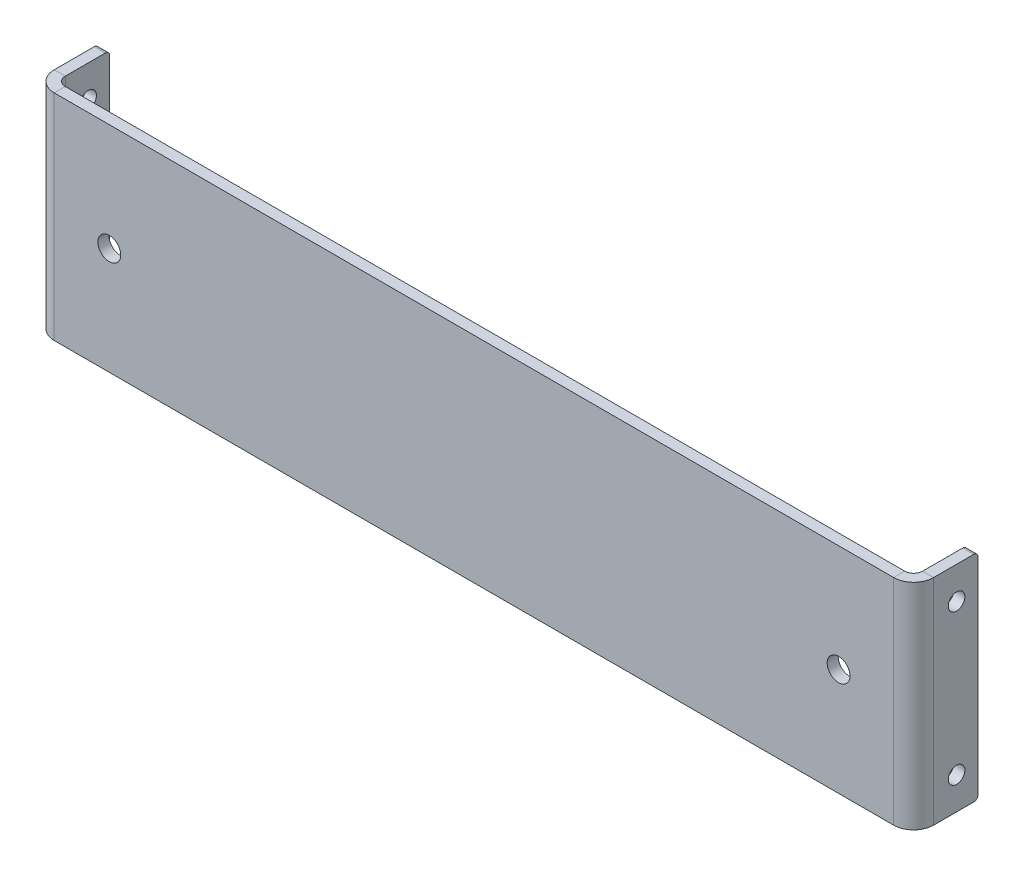
ISO-10303-21;
HEADER;
FILE_DESCRIPTION(('STEP AP214'),'2;1');
FILE_NAME('part.step','',(''),(''),'','','');
FILE_SCHEMA(('AUTOMOTIVE_DESIGN { 1 0 10303 214 1 1 1 1 }'));
ENDSEC;
DATA;
#1=APPLICATION_CONTEXT('core data for automotive mechanical design processes');
#2=APPLICATION_PROTOCOL_DEFINITION('international standard','automotive_design',2000,#1);
#3=PRODUCT_CONTEXT('',#1,'mechanical');
#4=PRODUCT('Part','Part','',(#3));
#5=PRODUCT_RELATED_PRODUCT_CATEGORY('part','',(#4));
#6=PRODUCT_DEFINITION_FORMATION('','',#4);
#7=PRODUCT_DEFINITION_CONTEXT('part definition',#1,'design');
#8=PRODUCT_DEFINITION('design','',#6,#7);
#9=PRODUCT_DEFINITION_SHAPE('','',#8);
#10=(LENGTH_UNIT() NAMED_UNIT(*) SI_UNIT(.MILLI.,.METRE.));
#11=(NAMED_UNIT(*) PLANE_ANGLE_UNIT() SI_UNIT($,.RADIAN.));
#12=(NAMED_UNIT(*) SI_UNIT($,.STERADIAN.) SOLID_ANGLE_UNIT());
#13=UNCERTAINTY_MEASURE_WITH_UNIT(LENGTH_MEASURE(1.E-05),#10,'distance_accuracy_value','');
#14=(GEOMETRIC_REPRESENTATION_CONTEXT(3) GLOBAL_UNCERTAINTY_ASSIGNED_CONTEXT((#13)) GLOBAL_UNIT_ASSIGNED_CONTEXT((#10,
#11,#12)) REPRESENTATION_CONTEXT('',''));
#15=CARTESIAN_POINT('',(0.,0.,0.));
#16=DIRECTION('',(0.,0.,1.));
#17=DIRECTION('',(1.,0.,0.));
#18=AXIS2_PLACEMENT_3D('',#15,#16,#17);
#19=CARTESIAN_POINT('',(0.,0.,-3.2639));
#20=DIRECTION('',(0.,0.,-1.));
#21=DIRECTION('',(-1.,0.,0.));
#22=AXIS2_PLACEMENT_3D('',#19,#20,#21);
#23=PLANE('',#22);
#24=CARTESIAN_POINT('',(-107.95,0.,-3.2639));
#25=DIRECTION('',(0.,0.,-1.));
#26=DIRECTION('',(-1.,0.,0.));
#27=AXIS2_PLACEMENT_3D('',#24,#25,#26);
#28=CIRCLE('',#27,3.3782);
#29=CARTESIAN_POINT('',(-111.3282,0.,-3.2639));
#30=VERTEX_POINT('',#29);
#31=EDGE_CURVE('E443',#30,#30,#28,.T.);
#32=ORIENTED_EDGE('',*,*,#31,.F.);
#33=EDGE_LOOP('',(#32));
#34=FACE_BOUND('',#33,.T.);
#35=CARTESIAN_POINT('',(107.95,0.,-3.2639));
#36=DIRECTION('',(0.,0.,-1.));
#37=DIRECTION('',(-1.,0.,0.));
#38=AXIS2_PLACEMENT_3D('',#35,#36,#37);
#39=CIRCLE('',#38,3.3782);
#40=CARTESIAN_POINT('',(104.5718,0.,-3.2639));
#41=VERTEX_POINT('',#40);
#42=EDGE_CURVE('E437',#41,#41,#39,.T.);
#43=ORIENTED_EDGE('',*,*,#42,.F.);
#44=EDGE_LOOP('',(#43));
#45=FACE_BOUND('',#44,.T.);
#46=DIRECTION('',(1.,0.,0.));
#47=VECTOR('',#46,1.);
#48=CARTESIAN_POINT('',(-130.175,-31.75,-3.2639));
#49=LINE('',#48,#47);
#50=CARTESIAN_POINT('',(-124.25426,-31.75,-3.26390000000002));
#51=VERTEX_POINT('',#50);
#52=CARTESIAN_POINT('',(124.25426,-31.75,-3.2639));
#53=VERTEX_POINT('',#52);
#54=EDGE_CURVE('E311',#51,#53,#49,.T.);
#55=ORIENTED_EDGE('',*,*,#54,.F.);
#56=DIRECTION('',(0.,1.,0.));
#57=VECTOR('',#56,1.);
#58=CARTESIAN_POINT('',(-124.25426,31.75,-3.26390000000002));
#59=LINE('',#58,#57);
#60=CARTESIAN_POINT('',(-124.25426,31.75,-3.26390000000002));
#61=VERTEX_POINT('',#60);
#62=EDGE_CURVE('E249',#61,#51,#59,.F.);
#63=ORIENTED_EDGE('',*,*,#62,.F.);
#64=DIRECTION('',(-1.,0.,0.));
#65=VECTOR('',#64,1.);
#66=CARTESIAN_POINT('',(-130.175,31.75,-3.2639));
#67=LINE('',#66,#65);
#68=CARTESIAN_POINT('',(124.25426,31.75,-3.2639));
#69=VERTEX_POINT('',#68);
#70=EDGE_CURVE('E308',#69,#61,#67,.T.);
#71=ORIENTED_EDGE('',*,*,#70,.F.);
#72=DIRECTION('',(0.,-1.,0.));
#73=VECTOR('',#72,1.);
#74=CARTESIAN_POINT('',(124.25426,-31.75,-3.26390000000002));
#75=LINE('',#74,#73);
#76=EDGE_CURVE('E298',#53,#69,#75,.F.);
#77=ORIENTED_EDGE('',*,*,#76,.F.);
#78=EDGE_LOOP('',(#55,#63,#71,#77));
#79=FACE_BOUND('',#78,.T.);
#80=ADVANCED_FACE('F78',(#34,#45,#79),#23,.T.);
#81=CARTESIAN_POINT('',(0.,0.,0.));
#82=DIRECTION('',(0.,0.,-1.));
#83=DIRECTION('',(-1.,0.,0.));
#84=AXIS2_PLACEMENT_3D('',#81,#82,#83);
#85=PLANE('',#84);
#86=CARTESIAN_POINT('',(-107.95,0.,0.));
#87=DIRECTION('',(0.,0.,1.));
#88=DIRECTION('',(1.,0.,0.));
#89=AXIS2_PLACEMENT_3D('',#86,#87,#88);
#90=CIRCLE('',#89,3.3782);
#91=CARTESIAN_POINT('',(-104.5718,0.,0.));
#92=VERTEX_POINT('',#91);
#93=EDGE_CURVE('E446',#92,#92,#90,.T.);
#94=ORIENTED_EDGE('',*,*,#93,.F.);
#95=EDGE_LOOP('',(#94));
#96=FACE_BOUND('',#95,.T.);
#97=CARTESIAN_POINT('',(107.95,0.,0.));
#98=DIRECTION('',(0.,0.,1.));
#99=DIRECTION('',(1.,0.,0.));
#100=AXIS2_PLACEMENT_3D('',#97,#98,#99);
#101=CIRCLE('',#100,3.3782);
#102=CARTESIAN_POINT('',(111.3282,0.,0.));
#103=VERTEX_POINT('',#102);
#104=EDGE_CURVE('E440',#103,#103,#101,.T.);
#105=ORIENTED_EDGE('',*,*,#104,.F.);
#106=EDGE_LOOP('',(#105));
#107=FACE_BOUND('',#106,.T.);
#108=DIRECTION('',(0.,1.,0.));
#109=VECTOR('',#108,1.);
#110=CARTESIAN_POINT('',(-124.25426,31.75,0.));
#111=LINE('',#110,#109);
#112=CARTESIAN_POINT('',(-124.25426,31.75,0.));
#113=VERTEX_POINT('',#112);
#114=CARTESIAN_POINT('',(-124.25426,-31.75,0.));
#115=VERTEX_POINT('',#114);
#116=EDGE_CURVE('E216',#113,#115,#111,.F.);
#117=ORIENTED_EDGE('',*,*,#116,.T.);
#118=DIRECTION('',(1.,0.,0.));
#119=VECTOR('',#118,1.);
#120=CARTESIAN_POINT('',(-130.175,-31.75,0.));
#121=LINE('',#120,#119);
#122=CARTESIAN_POINT('',(124.25426,-31.75,0.));
#123=VERTEX_POINT('',#122);
#124=EDGE_CURVE('E312',#115,#123,#121,.T.);
#125=ORIENTED_EDGE('',*,*,#124,.T.);
#126=DIRECTION('',(0.,-1.,0.));
#127=VECTOR('',#126,1.);
#128=CARTESIAN_POINT('',(124.25426,-31.75,0.));
#129=LINE('',#128,#127);
#130=CARTESIAN_POINT('',(124.25426,31.75,0.));
#131=VERTEX_POINT('',#130);
#132=EDGE_CURVE('E286',#123,#131,#129,.F.);
#133=ORIENTED_EDGE('',*,*,#132,.T.);
#134=DIRECTION('',(-1.,0.,0.));
#135=VECTOR('',#134,1.);
#136=CARTESIAN_POINT('',(-130.175,31.75,0.));
#137=LINE('',#136,#135);
#138=EDGE_CURVE('E306',#131,#113,#137,.T.);
#139=ORIENTED_EDGE('',*,*,#138,.T.);
#140=EDGE_LOOP('',(#117,#125,#133,#139));
#141=FACE_BOUND('',#140,.T.);
#142=ADVANCED_FACE('F389',(#96,#107,#141),#85,.F.);
#143=CARTESIAN_POINT('',(-130.175,31.75,-3.2639));
#144=DIRECTION('',(0.,1.,0.));
#145=DIRECTION('',(0.,0.,1.));
#146=AXIS2_PLACEMENT_3D('',#143,#144,#145);
#147=PLANE('',#146);
#148=ORIENTED_EDGE('',*,*,#70,.T.);
#149=DIRECTION('',(0.,0.,1.));
#150=VECTOR('',#149,1.);
#151=CARTESIAN_POINT('',(-124.25426,31.75,-3.26390000000002));
#152=LINE('',#151,#150);
#153=EDGE_CURVE('E245',#61,#113,#152,.T.);
#154=ORIENTED_EDGE('',*,*,#153,.T.);
#155=ORIENTED_EDGE('',*,*,#138,.F.);
#156=DIRECTION('',(0.,0.,1.));
#157=VECTOR('',#156,1.);
#158=CARTESIAN_POINT('',(124.25426,31.75,-3.26390000000002));
#159=LINE('',#158,#157);
#160=EDGE_CURVE('E303',#69,#131,#159,.T.);
#161=ORIENTED_EDGE('',*,*,#160,.F.);
#162=EDGE_LOOP('',(#148,#154,#155,#161));
#163=FACE_BOUND('',#162,.T.);
#164=ADVANCED_FACE('F392',(#163),#147,.T.);
#165=CARTESIAN_POINT('',(-130.175,-31.75,-3.2639));
#166=DIRECTION('',(0.,-1.,0.));
#167=DIRECTION('',(0.,0.,-1.));
#168=AXIS2_PLACEMENT_3D('',#165,#166,#167);
#169=PLANE('',#168);
#170=DIRECTION('',(0.,0.,1.));
#171=VECTOR('',#170,1.);
#172=CARTESIAN_POINT('',(-124.25426,-31.75,-3.26390000000002));
#173=LINE('',#172,#171);
#174=EDGE_CURVE('E253',#51,#115,#173,.T.);
#175=ORIENTED_EDGE('',*,*,#174,.F.);
#176=ORIENTED_EDGE('',*,*,#54,.T.);
#177=DIRECTION('',(0.,0.,1.));
#178=VECTOR('',#177,1.);
#179=CARTESIAN_POINT('',(124.25426,-31.75,-3.26390000000002));
#180=LINE('',#179,#178);
#181=EDGE_CURVE('E292',#53,#123,#180,.T.);
#182=ORIENTED_EDGE('',*,*,#181,.T.);
#183=ORIENTED_EDGE('',*,*,#124,.F.);
#184=EDGE_LOOP('',(#175,#176,#182,#183));
#185=FACE_BOUND('',#184,.T.);
#186=ADVANCED_FACE('F387',(#185),#169,.T.);
#187=CARTESIAN_POINT('',(124.25426,31.75,-5.92074000000002));
#188=DIRECTION('',(0.,1.,0.));
#189=DIRECTION('',(0.,0.,1.));
#190=AXIS2_PLACEMENT_3D('',#187,#188,#189);
#191=PLANE('',#190);
#192=DIRECTION('',(1.,0.,0.));
#193=VECTOR('',#192,1.);
#194=CARTESIAN_POINT('',(130.175,31.75,-5.92074));
#195=LINE('',#194,#193);
#196=CARTESIAN_POINT('',(126.9111,31.75,-5.92074000000001));
#197=VERTEX_POINT('',#196);
#198=CARTESIAN_POINT('',(130.175,31.75,-5.92074));
#199=VERTEX_POINT('',#198);
#200=EDGE_CURVE('E256',#197,#199,#195,.T.);
#201=ORIENTED_EDGE('',*,*,#200,.F.);
#202=CARTESIAN_POINT('',(124.25426,31.75,-5.92074000000002));
#203=DIRECTION('',(0.,-1.,0.));
#204=DIRECTION('',(0.,0.,-1.));
#205=AXIS2_PLACEMENT_3D('',#202,#203,#204);
#206=CIRCLE('',#205,2.65683999999999);
#207=EDGE_CURVE('E295',#69,#197,#206,.F.);
#208=ORIENTED_EDGE('',*,*,#207,.F.);
#209=ORIENTED_EDGE('',*,*,#160,.T.);
#210=CARTESIAN_POINT('',(124.25426,31.75,-5.92074000000002));
#211=DIRECTION('',(0.,-1.,0.));
#212=DIRECTION('',(0.,0.,-1.));
#213=AXIS2_PLACEMENT_3D('',#210,#211,#212);
#214=CIRCLE('',#213,5.92073999999999);
#215=EDGE_CURVE('E288',#131,#199,#214,.F.);
#216=ORIENTED_EDGE('',*,*,#215,.T.);
#217=EDGE_LOOP('',(#201,#208,#209,#216));
#218=FACE_BOUND('',#217,.T.);
#219=ADVANCED_FACE('F373',(#218),#191,.T.);
#220=CARTESIAN_POINT('',(124.25426,-31.75,-5.92074000000002));
#221=DIRECTION('',(0.,1.,0.));
#222=DIRECTION('',(0.,0.,1.));
#223=AXIS2_PLACEMENT_3D('',#220,#221,#222);
#224=PLANE('',#223);
#225=CARTESIAN_POINT('',(124.25426,-31.75,-5.92074000000002));
#226=DIRECTION('',(0.,-1.,0.));
#227=DIRECTION('',(0.,0.,-1.));
#228=AXIS2_PLACEMENT_3D('',#225,#226,#227);
#229=CIRCLE('',#228,2.65683999999999);
#230=CARTESIAN_POINT('',(126.9111,-31.75,-5.92074000000001));
#231=VERTEX_POINT('',#230);
#232=EDGE_CURVE('E261',#231,#53,#229,.T.);
#233=ORIENTED_EDGE('',*,*,#232,.F.);
#234=DIRECTION('',(1.,0.,0.));
#235=VECTOR('',#234,1.);
#236=CARTESIAN_POINT('',(126.9111,-31.75,-5.92074000000001));
#237=LINE('',#236,#235);
#238=CARTESIAN_POINT('',(130.175,-31.75,-5.92074));
#239=VERTEX_POINT('',#238);
#240=EDGE_CURVE('E278',#231,#239,#237,.T.);
#241=ORIENTED_EDGE('',*,*,#240,.T.);
#242=CARTESIAN_POINT('',(124.25426,-31.75,-5.92074000000002));
#243=DIRECTION('',(0.,-1.,0.));
#244=DIRECTION('',(0.,0.,-1.));
#245=AXIS2_PLACEMENT_3D('',#242,#243,#244);
#246=CIRCLE('',#245,5.92073999999999);
#247=EDGE_CURVE('E289',#239,#123,#246,.T.);
#248=ORIENTED_EDGE('',*,*,#247,.T.);
#249=ORIENTED_EDGE('',*,*,#181,.F.);
#250=EDGE_LOOP('',(#233,#241,#248,#249));
#251=FACE_BOUND('',#250,.T.);
#252=ADVANCED_FACE('F366',(#251),#224,.F.);
#253=CARTESIAN_POINT('',(124.25426,-31.75,-5.92074000000002));
#254=DIRECTION('',(0.,-1.,0.));
#255=DIRECTION('',(1.,0.,0.));
#256=AXIS2_PLACEMENT_3D('',#253,#254,#255);
#257=CYLINDRICAL_SURFACE('',#256,5.92073999999999);
#258=ORIENTED_EDGE('',*,*,#132,.F.);
#259=ORIENTED_EDGE('',*,*,#247,.F.);
#260=DIRECTION('',(0.,-1.,0.));
#261=VECTOR('',#260,1.);
#262=CARTESIAN_POINT('',(130.175,0.,-5.92074));
#263=LINE('',#262,#261);
#264=EDGE_CURVE('E275',#199,#239,#263,.T.);
#265=ORIENTED_EDGE('',*,*,#264,.F.);
#266=ORIENTED_EDGE('',*,*,#215,.F.);
#267=EDGE_LOOP('',(#258,#259,#265,#266));
#268=FACE_BOUND('',#267,.T.);
#269=ADVANCED_FACE('F371',(#268),#257,.T.);
#270=CARTESIAN_POINT('',(124.25426,-31.75,-5.92074000000002));
#271=DIRECTION('',(0.,-1.,0.));
#272=DIRECTION('',(1.,0.,0.));
#273=AXIS2_PLACEMENT_3D('',#270,#271,#272);
#274=CYLINDRICAL_SURFACE('',#273,2.65683999999999);
#275=ORIENTED_EDGE('',*,*,#76,.T.);
#276=ORIENTED_EDGE('',*,*,#207,.T.);
#277=DIRECTION('',(0.,1.,0.));
#278=VECTOR('',#277,1.);
#279=CARTESIAN_POINT('',(126.9111,31.75,-5.92074000000001));
#280=LINE('',#279,#278);
#281=EDGE_CURVE('E281',#197,#231,#280,.F.);
#282=ORIENTED_EDGE('',*,*,#281,.T.);
#283=ORIENTED_EDGE('',*,*,#232,.T.);
#284=EDGE_LOOP('',(#275,#276,#282,#283));
#285=FACE_BOUND('',#284,.T.);
#286=ADVANCED_FACE('F380',(#285),#274,.F.);
#287=CARTESIAN_POINT('',(130.175,-31.75,-3.26389999999999));
#288=DIRECTION('',(0.,-1.,0.));
#289=DIRECTION('',(0.,0.,-1.));
#290=AXIS2_PLACEMENT_3D('',#287,#288,#289);
#291=PLANE('',#290);
#292=DIRECTION('',(0.,0.,-1.));
#293=VECTOR('',#292,1.);
#294=CARTESIAN_POINT('',(126.9111,-31.75,4.57754867353493E-13));
#295=LINE('',#294,#293);
#296=CARTESIAN_POINT('',(126.9111,-31.75,-17.78));
#297=VERTEX_POINT('',#296);
#298=EDGE_CURVE('E267',#297,#231,#295,.F.);
#299=ORIENTED_EDGE('',*,*,#298,.F.);
#300=DIRECTION('',(-1.,0.,0.));
#301=VECTOR('',#300,1.);
#302=CARTESIAN_POINT('',(130.175,-31.75,-17.78));
#303=LINE('',#302,#301);
#304=CARTESIAN_POINT('',(130.175,-31.75,-17.78));
#305=VERTEX_POINT('',#304);
#306=EDGE_CURVE('E101',#297,#305,#303,.F.);
#307=ORIENTED_EDGE('',*,*,#306,.T.);
#308=DIRECTION('',(0.,0.,1.));
#309=VECTOR('',#308,1.);
#310=CARTESIAN_POINT('',(130.175,-31.75,-3.26389999999999));
#311=LINE('',#310,#309);
#312=EDGE_CURVE('E259',#305,#239,#311,.T.);
#313=ORIENTED_EDGE('',*,*,#312,.T.);
#314=ORIENTED_EDGE('',*,*,#240,.F.);
#315=EDGE_LOOP('',(#299,#307,#313,#314));
#316=FACE_BOUND('',#315,.T.);
#317=ADVANCED_FACE('F362',(#316),#291,.T.);
#318=CARTESIAN_POINT('',(130.175,31.75,-19.05));
#319=DIRECTION('',(0.,1.,0.));
#320=DIRECTION('',(0.,0.,1.));
#321=AXIS2_PLACEMENT_3D('',#318,#319,#320);
#322=PLANE('',#321);
#323=DIRECTION('',(0.,0.,-1.));
#324=VECTOR('',#323,1.);
#325=CARTESIAN_POINT('',(130.175,31.75,-19.05));
#326=LINE('',#325,#324);
#327=CARTESIAN_POINT('',(130.175,31.75,-17.78));
#328=VERTEX_POINT('',#327);
#329=EDGE_CURVE('E265',#199,#328,#326,.T.);
#330=ORIENTED_EDGE('',*,*,#329,.T.);
#331=DIRECTION('',(-1.,0.,0.));
#332=VECTOR('',#331,1.);
#333=CARTESIAN_POINT('',(130.175,31.75,-17.78));
#334=LINE('',#333,#332);
#335=CARTESIAN_POINT('',(126.9111,31.75,-17.78));
#336=VERTEX_POINT('',#335);
#337=EDGE_CURVE('E13',#328,#336,#334,.T.);
#338=ORIENTED_EDGE('',*,*,#337,.T.);
#339=DIRECTION('',(0.,0.,1.));
#340=VECTOR('',#339,1.);
#341=CARTESIAN_POINT('',(126.9111,31.75,4.43798926275643E-13));
#342=LINE('',#341,#340);
#343=EDGE_CURVE('E272',#197,#336,#342,.F.);
#344=ORIENTED_EDGE('',*,*,#343,.F.);
#345=ORIENTED_EDGE('',*,*,#200,.T.);
#346=EDGE_LOOP('',(#330,#338,#344,#345));
#347=FACE_BOUND('',#346,.T.);
#348=ADVANCED_FACE('F377',(#347),#322,.T.);
#349=CARTESIAN_POINT('',(130.175,0.,4.69150713295343E-13));
#350=DIRECTION('',(1.,0.,0.));
#351=DIRECTION('',(0.,0.,-1.));
#352=AXIS2_PLACEMENT_3D('',#349,#350,#351);
#353=PLANE('',#352);
#354=CARTESIAN_POINT('',(130.175,22.225,-12.7));
#355=DIRECTION('',(1.,0.,0.));
#356=DIRECTION('',(0.,0.,-1.));
#357=AXIS2_PLACEMENT_3D('',#354,#355,#356);
#358=CIRCLE('',#357,2.45745);
#359=CARTESIAN_POINT('',(130.175,22.225,-15.15745));
#360=VERTEX_POINT('',#359);
#361=EDGE_CURVE('E434',#360,#360,#358,.T.);
#362=ORIENTED_EDGE('',*,*,#361,.F.);
#363=EDGE_LOOP('',(#362));
#364=FACE_BOUND('',#363,.T.);
#365=CARTESIAN_POINT('',(130.175,-22.225,-12.7));
#366=DIRECTION('',(1.,0.,0.));
#367=DIRECTION('',(0.,0.,-1.));
#368=AXIS2_PLACEMENT_3D('',#365,#366,#367);
#369=CIRCLE('',#368,2.45745);
#370=CARTESIAN_POINT('',(130.175,-22.225,-15.15745));
#371=VERTEX_POINT('',#370);
#372=EDGE_CURVE('E427',#371,#371,#369,.T.);
#373=ORIENTED_EDGE('',*,*,#372,.F.);
#374=EDGE_LOOP('',(#373));
#375=FACE_BOUND('',#374,.T.);
#376=ORIENTED_EDGE('',*,*,#312,.F.);
#377=CARTESIAN_POINT('',(130.175,-30.48,-17.78));
#378=DIRECTION('',(1.,0.,0.));
#379=DIRECTION('',(0.,0.,-1.));
#380=AXIS2_PLACEMENT_3D('',#377,#378,#379);
#381=CIRCLE('',#380,1.27);
#382=CARTESIAN_POINT('',(130.175,-30.48,-19.05));
#383=VERTEX_POINT('',#382);
#384=EDGE_CURVE('E86',#305,#383,#381,.T.);
#385=ORIENTED_EDGE('',*,*,#384,.T.);
#386=DIRECTION('',(0.,-1.,0.));
#387=VECTOR('',#386,1.);
#388=CARTESIAN_POINT('',(130.175,-31.75,-19.05));
#389=LINE('',#388,#387);
#390=CARTESIAN_POINT('',(130.175,30.48,-19.05));
#391=VERTEX_POINT('',#390);
#392=EDGE_CURVE('E262',#391,#383,#389,.T.);
#393=ORIENTED_EDGE('',*,*,#392,.F.);
#394=CARTESIAN_POINT('',(130.175,30.48,-17.78));
#395=DIRECTION('',(1.,0.,0.));
#396=DIRECTION('',(0.,0.,-1.));
#397=AXIS2_PLACEMENT_3D('',#394,#395,#396);
#398=CIRCLE('',#397,1.27);
#399=EDGE_CURVE('E93',#391,#328,#398,.T.);
#400=ORIENTED_EDGE('',*,*,#399,.T.);
#401=ORIENTED_EDGE('',*,*,#329,.F.);
#402=ORIENTED_EDGE('',*,*,#264,.T.);
#403=EDGE_LOOP('',(#376,#385,#393,#400,#401,#402));
#404=FACE_BOUND('',#403,.T.);
#405=ADVANCED_FACE('F350',(#364,#375,#404),#353,.T.);
#406=CARTESIAN_POINT('',(126.9111,0.,4.57754867353493E-13));
#407=DIRECTION('',(1.,0.,0.));
#408=DIRECTION('',(0.,0.,-1.));
#409=AXIS2_PLACEMENT_3D('',#406,#407,#408);
#410=PLANE('',#409);
#411=CARTESIAN_POINT('',(126.9111,22.225,-12.7));
#412=DIRECTION('',(1.,0.,0.));
#413=DIRECTION('',(0.,0.,-1.));
#414=AXIS2_PLACEMENT_3D('',#411,#412,#413);
#415=CIRCLE('',#414,2.45744999999998);
#416=CARTESIAN_POINT('',(126.9111,22.225,-15.15745));
#417=VERTEX_POINT('',#416);
#418=EDGE_CURVE('E321',#417,#417,#415,.T.);
#419=ORIENTED_EDGE('',*,*,#418,.T.);
#420=EDGE_LOOP('',(#419));
#421=FACE_BOUND('',#420,.T.);
#422=CARTESIAN_POINT('',(126.9111,-22.225,-12.7));
#423=DIRECTION('',(1.,0.,0.));
#424=DIRECTION('',(0.,0.,-1.));
#425=AXIS2_PLACEMENT_3D('',#422,#423,#424);
#426=CIRCLE('',#425,2.45744999999998);
#427=CARTESIAN_POINT('',(126.9111,-22.225,-15.15745));
#428=VERTEX_POINT('',#427);
#429=EDGE_CURVE('E242',#428,#428,#426,.T.);
#430=ORIENTED_EDGE('',*,*,#429,.T.);
#431=EDGE_LOOP('',(#430));
#432=FACE_BOUND('',#431,.T.);
#433=DIRECTION('',(0.,1.,0.));
#434=VECTOR('',#433,1.);
#435=CARTESIAN_POINT('',(126.9111,0.,-19.05));
#436=LINE('',#435,#434);
#437=CARTESIAN_POINT('',(126.9111,30.48,-19.05));
#438=VERTEX_POINT('',#437);
#439=CARTESIAN_POINT('',(126.9111,-30.48,-19.05));
#440=VERTEX_POINT('',#439);
#441=EDGE_CURVE('E269',#438,#440,#436,.F.);
#442=ORIENTED_EDGE('',*,*,#441,.T.);
#443=CARTESIAN_POINT('',(126.9111,-30.48,-17.78));
#444=DIRECTION('',(1.,0.,0.));
#445=DIRECTION('',(0.,0.,-1.));
#446=AXIS2_PLACEMENT_3D('',#443,#444,#445);
#447=CIRCLE('',#446,1.27);
#448=EDGE_CURVE('E346',#440,#297,#447,.F.);
#449=ORIENTED_EDGE('',*,*,#448,.T.);
#450=ORIENTED_EDGE('',*,*,#298,.T.);
#451=ORIENTED_EDGE('',*,*,#281,.F.);
#452=ORIENTED_EDGE('',*,*,#343,.T.);
#453=CARTESIAN_POINT('',(126.9111,30.48,-17.78));
#454=DIRECTION('',(1.,0.,0.));
#455=DIRECTION('',(0.,0.,-1.));
#456=AXIS2_PLACEMENT_3D('',#453,#454,#455);
#457=CIRCLE('',#456,1.27);
#458=EDGE_CURVE('E344',#336,#438,#457,.F.);
#459=ORIENTED_EDGE('',*,*,#458,.T.);
#460=EDGE_LOOP('',(#442,#449,#450,#451,#452,#459));
#461=FACE_BOUND('',#460,.T.);
#462=ADVANCED_FACE('F359',(#421,#432,#461),#410,.F.);
#463=CARTESIAN_POINT('',(130.175,-31.75,-19.05));
#464=DIRECTION('',(0.,0.,-1.));
#465=DIRECTION('',(-1.,0.,0.));
#466=AXIS2_PLACEMENT_3D('',#463,#464,#465);
#467=PLANE('',#466);
#468=ORIENTED_EDGE('',*,*,#392,.T.);
#469=DIRECTION('',(-1.,0.,0.));
#470=VECTOR('',#469,1.);
#471=CARTESIAN_POINT('',(130.175,-30.48,-19.05));
#472=LINE('',#471,#470);
#473=EDGE_CURVE('E341',#383,#440,#472,.T.);
#474=ORIENTED_EDGE('',*,*,#473,.T.);
#475=ORIENTED_EDGE('',*,*,#441,.F.);
#476=DIRECTION('',(-1.,0.,0.));
#477=VECTOR('',#476,1.);
#478=CARTESIAN_POINT('',(130.175,30.48,-19.05));
#479=LINE('',#478,#477);
#480=EDGE_CURVE('E339',#438,#391,#479,.F.);
#481=ORIENTED_EDGE('',*,*,#480,.T.);
#482=EDGE_LOOP('',(#468,#474,#475,#481));
#483=FACE_BOUND('',#482,.T.);
#484=ADVANCED_FACE('F354',(#483),#467,.T.);
#485=CARTESIAN_POINT('',(-124.25426,-31.75,-5.92074000000002));
#486=DIRECTION('',(0.,-1.,0.));
#487=DIRECTION('',(0.,0.,-1.));
#488=AXIS2_PLACEMENT_3D('',#485,#486,#487);
#489=PLANE('',#488);
#490=DIRECTION('',(-1.,0.,0.));
#491=VECTOR('',#490,1.);
#492=CARTESIAN_POINT('',(-130.175,-31.75,-5.92074));
#493=LINE('',#492,#491);
#494=CARTESIAN_POINT('',(-126.9111,-31.75,-5.92074000000001));
#495=VERTEX_POINT('',#494);
#496=CARTESIAN_POINT('',(-130.175,-31.75,-5.92074));
#497=VERTEX_POINT('',#496);
#498=EDGE_CURVE('E239',#495,#497,#493,.T.);
#499=ORIENTED_EDGE('',*,*,#498,.F.);
#500=CARTESIAN_POINT('',(-124.25426,-31.75,-5.92074000000002));
#501=DIRECTION('',(0.,1.,0.));
#502=DIRECTION('',(0.,0.,1.));
#503=AXIS2_PLACEMENT_3D('',#500,#501,#502);
#504=CIRCLE('',#503,2.65683999999999);
#505=EDGE_CURVE('E219',#51,#495,#504,.F.);
#506=ORIENTED_EDGE('',*,*,#505,.F.);
#507=ORIENTED_EDGE('',*,*,#174,.T.);
#508=CARTESIAN_POINT('',(-124.25426,-31.75,-5.92074000000002));
#509=DIRECTION('',(0.,1.,0.));
#510=DIRECTION('',(0.,0.,1.));
#511=AXIS2_PLACEMENT_3D('',#508,#509,#510);
#512=CIRCLE('',#511,5.92073999999999);
#513=EDGE_CURVE('E244',#115,#497,#512,.F.);
#514=ORIENTED_EDGE('',*,*,#513,.T.);
#515=EDGE_LOOP('',(#499,#506,#507,#514));
#516=FACE_BOUND('',#515,.T.);
#517=ADVANCED_FACE('F587',(#516),#489,.T.);
#518=CARTESIAN_POINT('',(-124.25426,31.75,-5.92074000000002));
#519=DIRECTION('',(0.,-1.,0.));
#520=DIRECTION('',(0.,0.,-1.));
#521=AXIS2_PLACEMENT_3D('',#518,#519,#520);
#522=PLANE('',#521);
#523=CARTESIAN_POINT('',(-124.25426,31.75,-5.92074000000002));
#524=DIRECTION('',(0.,1.,0.));
#525=DIRECTION('',(0.,0.,1.));
#526=AXIS2_PLACEMENT_3D('',#523,#524,#525);
#527=CIRCLE('',#526,2.65683999999999);
#528=CARTESIAN_POINT('',(-126.9111,31.75,-5.92074000000001));
#529=VERTEX_POINT('',#528);
#530=EDGE_CURVE('E205',#529,#61,#527,.T.);
#531=ORIENTED_EDGE('',*,*,#530,.F.);
#532=DIRECTION('',(-1.,0.,0.));
#533=VECTOR('',#532,1.);
#534=CARTESIAN_POINT('',(-126.9111,31.75,-5.92074000000001));
#535=LINE('',#534,#533);
#536=CARTESIAN_POINT('',(-130.175,31.75,-5.92074));
#537=VERTEX_POINT('',#536);
#538=EDGE_CURVE('E199',#529,#537,#535,.T.);
#539=ORIENTED_EDGE('',*,*,#538,.T.);
#540=CARTESIAN_POINT('',(-124.25426,31.75,-5.92074000000002));
#541=DIRECTION('',(0.,1.,0.));
#542=DIRECTION('',(0.,0.,1.));
#543=AXIS2_PLACEMENT_3D('',#540,#541,#542);
#544=CIRCLE('',#543,5.92073999999999);
#545=EDGE_CURVE('E211',#537,#113,#544,.T.);
#546=ORIENTED_EDGE('',*,*,#545,.T.);
#547=ORIENTED_EDGE('',*,*,#153,.F.);
#548=EDGE_LOOP('',(#531,#539,#546,#547));
#549=FACE_BOUND('',#548,.T.);
#550=ADVANCED_FACE('F222',(#549),#522,.F.);
#551=CARTESIAN_POINT('',(-124.25426,31.75,-5.92074000000002));
#552=DIRECTION('',(0.,1.,0.));
#553=DIRECTION('',(-1.,0.,0.));
#554=AXIS2_PLACEMENT_3D('',#551,#552,#553);
#555=CYLINDRICAL_SURFACE('',#554,5.92073999999999);
#556=ORIENTED_EDGE('',*,*,#116,.F.);
#557=ORIENTED_EDGE('',*,*,#545,.F.);
#558=DIRECTION('',(0.,1.,0.));
#559=VECTOR('',#558,1.);
#560=CARTESIAN_POINT('',(-130.175,-31.75,-5.92074));
#561=LINE('',#560,#559);
#562=EDGE_CURVE('E214',#537,#497,#561,.F.);
#563=ORIENTED_EDGE('',*,*,#562,.T.);
#564=ORIENTED_EDGE('',*,*,#513,.F.);
#565=EDGE_LOOP('',(#556,#557,#563,#564));
#566=FACE_BOUND('',#565,.T.);
#567=ADVANCED_FACE('F212',(#566),#555,.T.);
#568=CARTESIAN_POINT('',(-124.25426,31.75,-5.92074000000002));
#569=DIRECTION('',(0.,1.,0.));
#570=DIRECTION('',(-1.,0.,0.));
#571=AXIS2_PLACEMENT_3D('',#568,#569,#570);
#572=CYLINDRICAL_SURFACE('',#571,2.65683999999999);
#573=ORIENTED_EDGE('',*,*,#62,.T.);
#574=ORIENTED_EDGE('',*,*,#505,.T.);
#575=DIRECTION('',(0.,1.,0.));
#576=VECTOR('',#575,1.);
#577=CARTESIAN_POINT('',(-126.9111,-31.75,-5.92074000000001));
#578=LINE('',#577,#576);
#579=EDGE_CURVE('E224',#495,#529,#578,.T.);
#580=ORIENTED_EDGE('',*,*,#579,.T.);
#581=ORIENTED_EDGE('',*,*,#530,.T.);
#582=EDGE_LOOP('',(#573,#574,#580,#581));
#583=FACE_BOUND('',#582,.T.);
#584=ADVANCED_FACE('F394',(#583),#572,.F.);
#585=CARTESIAN_POINT('',(-130.175,-31.75,-3.26389999999999));
#586=DIRECTION('',(0.,-1.,0.));
#587=DIRECTION('',(0.,0.,-1.));
#588=AXIS2_PLACEMENT_3D('',#585,#586,#587);
#589=PLANE('',#588);
#590=DIRECTION('',(0.,0.,1.));
#591=VECTOR('',#590,1.);
#592=CARTESIAN_POINT('',(-130.175,-31.75,-3.26389999999999));
#593=LINE('',#592,#591);
#594=CARTESIAN_POINT('',(-130.175,-31.75,-17.78));
#595=VERTEX_POINT('',#594);
#596=EDGE_CURVE('E229',#497,#595,#593,.F.);
#597=ORIENTED_EDGE('',*,*,#596,.T.);
#598=DIRECTION('',(1.,0.,0.));
#599=VECTOR('',#598,1.);
#600=CARTESIAN_POINT('',(-130.175,-31.75,-17.78));
#601=LINE('',#600,#599);
#602=CARTESIAN_POINT('',(-126.9111,-31.75,-17.78));
#603=VERTEX_POINT('',#602);
#604=EDGE_CURVE('E336',#595,#603,#601,.T.);
#605=ORIENTED_EDGE('',*,*,#604,.T.);
#606=DIRECTION('',(0.,0.,-1.));
#607=VECTOR('',#606,1.);
#608=CARTESIAN_POINT('',(-126.9111,-31.75,4.57754867353493E-13));
#609=LINE('',#608,#607);
#610=EDGE_CURVE('E230',#495,#603,#609,.T.);
#611=ORIENTED_EDGE('',*,*,#610,.F.);
#612=ORIENTED_EDGE('',*,*,#498,.T.);
#613=EDGE_LOOP('',(#597,#605,#611,#612));
#614=FACE_BOUND('',#613,.T.);
#615=ADVANCED_FACE('F403',(#614),#589,.T.);
#616=CARTESIAN_POINT('',(-130.175,31.75,-19.05));
#617=DIRECTION('',(0.,1.,0.));
#618=DIRECTION('',(0.,0.,1.));
#619=AXIS2_PLACEMENT_3D('',#616,#617,#618);
#620=PLANE('',#619);
#621=DIRECTION('',(0.,0.,1.));
#622=VECTOR('',#621,1.);
#623=CARTESIAN_POINT('',(-126.9111,31.75,4.43798926275643E-13));
#624=LINE('',#623,#622);
#625=CARTESIAN_POINT('',(-126.9111,31.75,-17.78));
#626=VERTEX_POINT('',#625);
#627=EDGE_CURVE('E401',#626,#529,#624,.T.);
#628=ORIENTED_EDGE('',*,*,#627,.F.);
#629=DIRECTION('',(1.,0.,0.));
#630=VECTOR('',#629,1.);
#631=CARTESIAN_POINT('',(-130.175,31.75,-17.78));
#632=LINE('',#631,#630);
#633=CARTESIAN_POINT('',(-130.175,31.75,-17.78));
#634=VERTEX_POINT('',#633);
#635=EDGE_CURVE('E201',#626,#634,#632,.F.);
#636=ORIENTED_EDGE('',*,*,#635,.T.);
#637=DIRECTION('',(0.,0.,-1.));
#638=VECTOR('',#637,1.);
#639=CARTESIAN_POINT('',(-130.175,31.75,-19.05));
#640=LINE('',#639,#638);
#641=EDGE_CURVE('E194',#634,#537,#640,.F.);
#642=ORIENTED_EDGE('',*,*,#641,.T.);
#643=ORIENTED_EDGE('',*,*,#538,.F.);
#644=EDGE_LOOP('',(#628,#636,#642,#643));
#645=FACE_BOUND('',#644,.T.);
#646=ADVANCED_FACE('F197',(#645),#620,.T.);
#647=CARTESIAN_POINT('',(-130.175,0.,4.69150713295344E-13));
#648=DIRECTION('',(1.,0.,0.));
#649=DIRECTION('',(0.,0.,-1.));
#650=AXIS2_PLACEMENT_3D('',#647,#648,#649);
#651=PLANE('',#650);
#652=CARTESIAN_POINT('',(-130.175,22.225,-12.7000000000009));
#653=DIRECTION('',(1.,0.,0.));
#654=DIRECTION('',(0.,0.,-1.));
#655=AXIS2_PLACEMENT_3D('',#652,#653,#654);
#656=CIRCLE('',#655,2.45744999999997);
#657=CARTESIAN_POINT('',(-130.175,22.225,-15.1574500000009));
#658=VERTEX_POINT('',#657);
#659=EDGE_CURVE('E322',#658,#658,#656,.T.);
#660=ORIENTED_EDGE('',*,*,#659,.T.);
#661=EDGE_LOOP('',(#660));
#662=FACE_BOUND('',#661,.T.);
#663=CARTESIAN_POINT('',(-130.175,-22.225,-12.7000000000009));
#664=DIRECTION('',(1.,0.,0.));
#665=DIRECTION('',(0.,0.,-1.));
#666=AXIS2_PLACEMENT_3D('',#663,#664,#665);
#667=CIRCLE('',#666,2.45744999999997);
#668=CARTESIAN_POINT('',(-130.175,-22.225,-15.1574500000009));
#669=VERTEX_POINT('',#668);
#670=EDGE_CURVE('E424',#669,#669,#667,.T.);
#671=ORIENTED_EDGE('',*,*,#670,.T.);
#672=EDGE_LOOP('',(#671));
#673=FACE_BOUND('',#672,.T.);
#674=ORIENTED_EDGE('',*,*,#641,.F.);
#675=CARTESIAN_POINT('',(-130.175,30.48,-17.78));
#676=DIRECTION('',(1.,0.,0.));
#677=DIRECTION('',(0.,0.,-1.));
#678=AXIS2_PLACEMENT_3D('',#675,#676,#677);
#679=CIRCLE('',#678,1.27);
#680=CARTESIAN_POINT('',(-130.175,30.48,-19.05));
#681=VERTEX_POINT('',#680);
#682=EDGE_CURVE('E334',#634,#681,#679,.F.);
#683=ORIENTED_EDGE('',*,*,#682,.T.);
#684=DIRECTION('',(0.,-1.,0.));
#685=VECTOR('',#684,1.);
#686=CARTESIAN_POINT('',(-130.175,-31.75,-19.05));
#687=LINE('',#686,#685);
#688=CARTESIAN_POINT('',(-130.175,-30.48,-19.05));
#689=VERTEX_POINT('',#688);
#690=EDGE_CURVE('E206',#689,#681,#687,.F.);
#691=ORIENTED_EDGE('',*,*,#690,.F.);
#692=CARTESIAN_POINT('',(-130.175,-30.48,-17.78));
#693=DIRECTION('',(1.,0.,0.));
#694=DIRECTION('',(0.,0.,-1.));
#695=AXIS2_PLACEMENT_3D('',#692,#693,#694);
#696=CIRCLE('',#695,1.27);
#697=EDGE_CURVE('E332',#689,#595,#696,.F.);
#698=ORIENTED_EDGE('',*,*,#697,.T.);
#699=ORIENTED_EDGE('',*,*,#596,.F.);
#700=ORIENTED_EDGE('',*,*,#562,.F.);
#701=EDGE_LOOP('',(#674,#683,#691,#698,#699,#700));
#702=FACE_BOUND('',#701,.T.);
#703=ADVANCED_FACE('F227',(#662,#673,#702),#651,.F.);
#704=CARTESIAN_POINT('',(-126.9111,0.,4.57754867353493E-13));
#705=DIRECTION('',(1.,0.,0.));
#706=DIRECTION('',(0.,0.,-1.));
#707=AXIS2_PLACEMENT_3D('',#704,#705,#706);
#708=PLANE('',#707);
#709=CARTESIAN_POINT('',(-126.9111,22.225,-12.7000000000009));
#710=DIRECTION('',(1.,0.,0.));
#711=DIRECTION('',(0.,0.,-1.));
#712=AXIS2_PLACEMENT_3D('',#709,#710,#711);
#713=CIRCLE('',#712,2.45744999999998);
#714=CARTESIAN_POINT('',(-126.9111,22.225,-15.1574500000009));
#715=VERTEX_POINT('',#714);
#716=EDGE_CURVE('E318',#715,#715,#713,.T.);
#717=ORIENTED_EDGE('',*,*,#716,.F.);
#718=EDGE_LOOP('',(#717));
#719=FACE_BOUND('',#718,.T.);
#720=CARTESIAN_POINT('',(-126.9111,-22.225,-12.7000000000009));
#721=DIRECTION('',(1.,0.,0.));
#722=DIRECTION('',(0.,0.,-1.));
#723=AXIS2_PLACEMENT_3D('',#720,#721,#722);
#724=CIRCLE('',#723,2.45744999999998);
#725=CARTESIAN_POINT('',(-126.9111,-22.225,-15.1574500000009));
#726=VERTEX_POINT('',#725);
#727=EDGE_CURVE('E421',#726,#726,#724,.T.);
#728=ORIENTED_EDGE('',*,*,#727,.F.);
#729=EDGE_LOOP('',(#728));
#730=FACE_BOUND('',#729,.T.);
#731=DIRECTION('',(0.,1.,0.));
#732=VECTOR('',#731,1.);
#733=CARTESIAN_POINT('',(-126.9111,0.,-19.05));
#734=LINE('',#733,#732);
#735=CARTESIAN_POINT('',(-126.9111,-30.48,-19.05));
#736=VERTEX_POINT('',#735);
#737=CARTESIAN_POINT('',(-126.9111,30.48,-19.05));
#738=VERTEX_POINT('',#737);
#739=EDGE_CURVE('E233',#736,#738,#734,.T.);
#740=ORIENTED_EDGE('',*,*,#739,.T.);
#741=CARTESIAN_POINT('',(-126.9111,30.48,-17.78));
#742=DIRECTION('',(1.,0.,0.));
#743=DIRECTION('',(0.,0.,-1.));
#744=AXIS2_PLACEMENT_3D('',#741,#742,#743);
#745=CIRCLE('',#744,1.27);
#746=EDGE_CURVE('E329',#738,#626,#745,.T.);
#747=ORIENTED_EDGE('',*,*,#746,.T.);
#748=ORIENTED_EDGE('',*,*,#627,.T.);
#749=ORIENTED_EDGE('',*,*,#579,.F.);
#750=ORIENTED_EDGE('',*,*,#610,.T.);
#751=CARTESIAN_POINT('',(-126.9111,-30.48,-17.78));
#752=DIRECTION('',(1.,0.,0.));
#753=DIRECTION('',(0.,0.,-1.));
#754=AXIS2_PLACEMENT_3D('',#751,#752,#753);
#755=CIRCLE('',#754,1.27);
#756=EDGE_CURVE('E327',#603,#736,#755,.T.);
#757=ORIENTED_EDGE('',*,*,#756,.T.);
#758=EDGE_LOOP('',(#740,#747,#748,#749,#750,#757));
#759=FACE_BOUND('',#758,.T.);
#760=ADVANCED_FACE('F400',(#719,#730,#759),#708,.T.);
#761=CARTESIAN_POINT('',(-130.175,-31.75,-19.05));
#762=DIRECTION('',(0.,0.,-1.));
#763=DIRECTION('',(-1.,0.,0.));
#764=AXIS2_PLACEMENT_3D('',#761,#762,#763);
#765=PLANE('',#764);
#766=ORIENTED_EDGE('',*,*,#690,.T.);
#767=DIRECTION('',(1.,0.,0.));
#768=VECTOR('',#767,1.);
#769=CARTESIAN_POINT('',(-130.175,30.48,-19.05));
#770=LINE('',#769,#768);
#771=EDGE_CURVE('E324',#681,#738,#770,.T.);
#772=ORIENTED_EDGE('',*,*,#771,.T.);
#773=ORIENTED_EDGE('',*,*,#739,.F.);
#774=DIRECTION('',(1.,0.,0.));
#775=VECTOR('',#774,1.);
#776=CARTESIAN_POINT('',(-130.175,-30.48,-19.05));
#777=LINE('',#776,#775);
#778=EDGE_CURVE('E314',#736,#689,#777,.F.);
#779=ORIENTED_EDGE('',*,*,#778,.T.);
#780=EDGE_LOOP('',(#766,#772,#773,#779));
#781=FACE_BOUND('',#780,.T.);
#782=ADVANCED_FACE('F412',(#781),#765,.T.);
#783=CARTESIAN_POINT('',(130.175,-22.225,-12.7));
#784=DIRECTION('',(1.,0.,0.));
#785=DIRECTION('',(0.,0.,-1.));
#786=AXIS2_PLACEMENT_3D('',#783,#784,#785);
#787=CYLINDRICAL_SURFACE('',#786,2.45744999999998);
#788=ORIENTED_EDGE('',*,*,#727,.T.);
#789=EDGE_LOOP('',(#788));
#790=FACE_BOUND('',#789,.T.);
#791=ORIENTED_EDGE('',*,*,#670,.F.);
#792=EDGE_LOOP('',(#791));
#793=FACE_BOUND('',#792,.T.);
#794=ADVANCED_FACE('F645',(#790,#793),#787,.F.);
#795=ORIENTED_EDGE('',*,*,#372,.T.);
#796=EDGE_LOOP('',(#795));
#797=FACE_BOUND('',#796,.T.);
#798=ORIENTED_EDGE('',*,*,#429,.F.);
#799=EDGE_LOOP('',(#798));
#800=FACE_BOUND('',#799,.T.);
#801=ADVANCED_FACE('F652',(#797,#800),#787,.F.);
#802=CARTESIAN_POINT('',(130.175,22.225,-12.7));
#803=DIRECTION('',(1.,0.,0.));
#804=DIRECTION('',(0.,0.,-1.));
#805=AXIS2_PLACEMENT_3D('',#802,#803,#804);
#806=CYLINDRICAL_SURFACE('',#805,2.45744999999998);
#807=ORIENTED_EDGE('',*,*,#716,.T.);
#808=EDGE_LOOP('',(#807));
#809=FACE_BOUND('',#808,.T.);
#810=ORIENTED_EDGE('',*,*,#659,.F.);
#811=EDGE_LOOP('',(#810));
#812=FACE_BOUND('',#811,.T.);
#813=ADVANCED_FACE('F660',(#809,#812),#806,.F.);
#814=ORIENTED_EDGE('',*,*,#361,.T.);
#815=EDGE_LOOP('',(#814));
#816=FACE_BOUND('',#815,.T.);
#817=ORIENTED_EDGE('',*,*,#418,.F.);
#818=EDGE_LOOP('',(#817));
#819=FACE_BOUND('',#818,.T.);
#820=ADVANCED_FACE('F486',(#816,#819),#806,.F.);
#821=CARTESIAN_POINT('',(-130.175,30.48,-17.78));
#822=DIRECTION('',(1.,0.,0.));
#823=DIRECTION('',(0.,0.,-1.));
#824=AXIS2_PLACEMENT_3D('',#821,#822,#823);
#825=CYLINDRICAL_SURFACE('',#824,1.27);
#826=ORIENTED_EDGE('',*,*,#682,.F.);
#827=ORIENTED_EDGE('',*,*,#635,.F.);
#828=ORIENTED_EDGE('',*,*,#746,.F.);
#829=ORIENTED_EDGE('',*,*,#771,.F.);
#830=EDGE_LOOP('',(#826,#827,#828,#829));
#831=FACE_BOUND('',#830,.T.);
#832=ADVANCED_FACE('F483',(#831),#825,.T.);
#833=CARTESIAN_POINT('',(-130.175,-30.48,-17.78));
#834=DIRECTION('',(1.,0.,0.));
#835=DIRECTION('',(0.,0.,-1.));
#836=AXIS2_PLACEMENT_3D('',#833,#834,#835);
#837=CYLINDRICAL_SURFACE('',#836,1.27);
#838=ORIENTED_EDGE('',*,*,#697,.F.);
#839=ORIENTED_EDGE('',*,*,#778,.F.);
#840=ORIENTED_EDGE('',*,*,#756,.F.);
#841=ORIENTED_EDGE('',*,*,#604,.F.);
#842=EDGE_LOOP('',(#838,#839,#840,#841));
#843=FACE_BOUND('',#842,.T.);
#844=ADVANCED_FACE('F407',(#843),#837,.T.);
#845=CARTESIAN_POINT('',(130.175,-30.48,-17.78));
#846=DIRECTION('',(-1.,0.,0.));
#847=DIRECTION('',(0.,0.,1.));
#848=AXIS2_PLACEMENT_3D('',#845,#846,#847);
#849=CYLINDRICAL_SURFACE('',#848,1.27);
#850=ORIENTED_EDGE('',*,*,#384,.F.);
#851=ORIENTED_EDGE('',*,*,#306,.F.);
#852=ORIENTED_EDGE('',*,*,#448,.F.);
#853=ORIENTED_EDGE('',*,*,#473,.F.);
#854=EDGE_LOOP('',(#850,#851,#852,#853));
#855=FACE_BOUND('',#854,.T.);
#856=ADVANCED_FACE('F357',(#855),#849,.T.);
#857=CARTESIAN_POINT('',(130.175,30.48,-17.78));
#858=DIRECTION('',(-1.,0.,0.));
#859=DIRECTION('',(0.,0.,1.));
#860=AXIS2_PLACEMENT_3D('',#857,#858,#859);
#861=CYLINDRICAL_SURFACE('',#860,1.27);
#862=ORIENTED_EDGE('',*,*,#399,.F.);
#863=ORIENTED_EDGE('',*,*,#480,.F.);
#864=ORIENTED_EDGE('',*,*,#458,.F.);
#865=ORIENTED_EDGE('',*,*,#337,.F.);
#866=EDGE_LOOP('',(#862,#863,#864,#865));
#867=FACE_BOUND('',#866,.T.);
#868=ADVANCED_FACE('F80',(#867),#861,.T.);
#869=CARTESIAN_POINT('',(107.95,0.,0.));
#870=DIRECTION('',(0.,0.,1.));
#871=DIRECTION('',(1.,0.,0.));
#872=AXIS2_PLACEMENT_3D('',#869,#870,#871);
#873=CYLINDRICAL_SURFACE('',#872,3.3782);
#874=ORIENTED_EDGE('',*,*,#42,.T.);
#875=EDGE_LOOP('',(#874));
#876=FACE_BOUND('',#875,.T.);
#877=ORIENTED_EDGE('',*,*,#104,.T.);
#878=EDGE_LOOP('',(#877));
#879=FACE_BOUND('',#878,.T.);
#880=ADVANCED_FACE('F457',(#876,#879),#873,.F.);
#881=CARTESIAN_POINT('',(-107.95,0.,0.));
#882=DIRECTION('',(0.,0.,1.));
#883=DIRECTION('',(1.,0.,0.));
#884=AXIS2_PLACEMENT_3D('',#881,#882,#883);
#885=CYLINDRICAL_SURFACE('',#884,3.3782);
#886=ORIENTED_EDGE('',*,*,#31,.T.);
#887=EDGE_LOOP('',(#886));
#888=FACE_BOUND('',#887,.T.);
#889=ORIENTED_EDGE('',*,*,#93,.T.);
#890=EDGE_LOOP('',(#889));
#891=FACE_BOUND('',#890,.T.);
#892=ADVANCED_FACE('F450',(#888,#891),#885,.F.);
#893=CLOSED_SHELL('',(#80,#142,#164,#186,#219,#252,#269,#286,#317,#348,#405,#462,#484,#517,#550,
#567,#584,#615,#646,#703,#760,#782,#794,#801,#813,#820,#832,#844,#856,#868,#880,#892));
#894=MANIFOLD_SOLID_BREP('B2',#893);
#895=ADVANCED_BREP_SHAPE_REPRESENTATION('',(#18,#894),#14);
#896=SHAPE_DEFINITION_REPRESENTATION(#9,#895);
ENDSEC;
END-ISO-10303-21;
